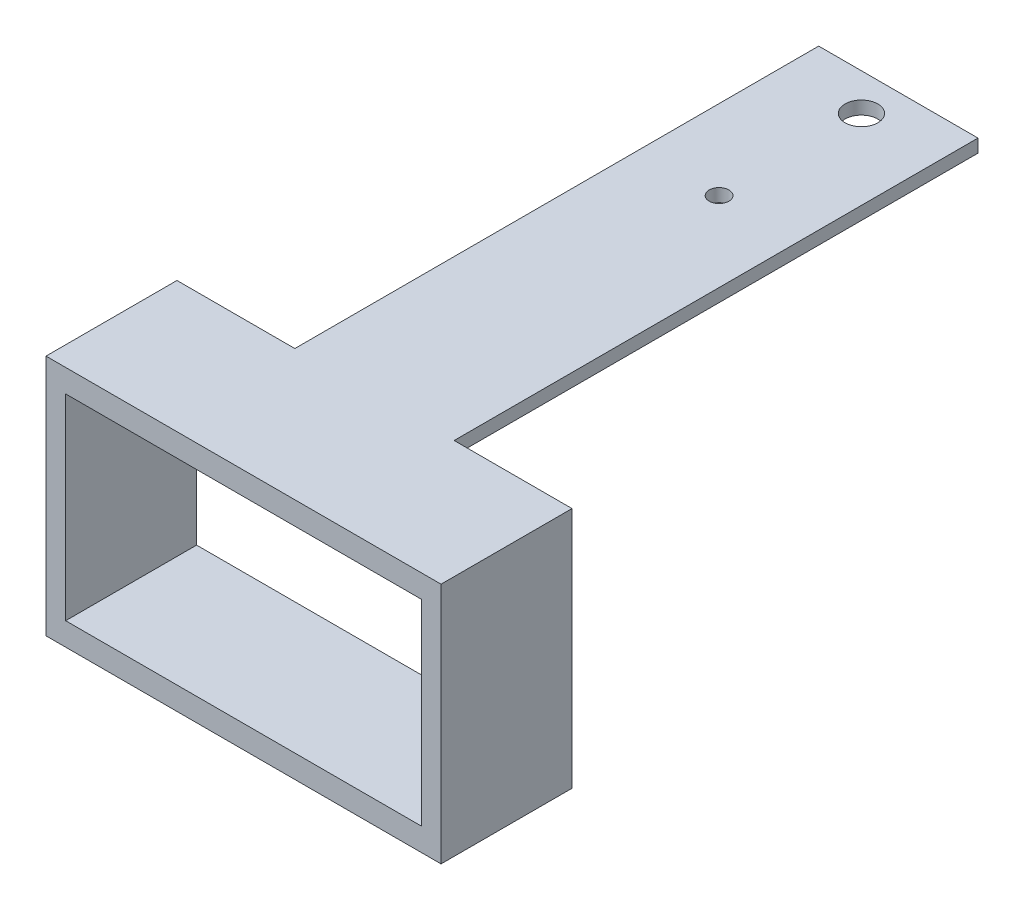
ISO-10303-21;
HEADER;
FILE_DESCRIPTION(('STEP AP214'),'2;1');
FILE_NAME('part.step','',(''),(''),'','','');
FILE_SCHEMA(('AUTOMOTIVE_DESIGN { 1 0 10303 214 1 1 1 1 }'));
ENDSEC;
DATA;
#1=APPLICATION_CONTEXT('core data for automotive mechanical design processes');
#2=APPLICATION_PROTOCOL_DEFINITION('international standard','automotive_design',2000,#1);
#3=PRODUCT_CONTEXT('',#1,'mechanical');
#4=PRODUCT('Part','Part','',(#3));
#5=PRODUCT_RELATED_PRODUCT_CATEGORY('part','',(#4));
#6=PRODUCT_DEFINITION_FORMATION('','',#4);
#7=PRODUCT_DEFINITION_CONTEXT('part definition',#1,'design');
#8=PRODUCT_DEFINITION('design','',#6,#7);
#9=PRODUCT_DEFINITION_SHAPE('','',#8);
#10=(LENGTH_UNIT() NAMED_UNIT(*) SI_UNIT(.MILLI.,.METRE.));
#11=(NAMED_UNIT(*) PLANE_ANGLE_UNIT() SI_UNIT($,.RADIAN.));
#12=(NAMED_UNIT(*) SI_UNIT($,.STERADIAN.) SOLID_ANGLE_UNIT());
#13=UNCERTAINTY_MEASURE_WITH_UNIT(LENGTH_MEASURE(1.E-05),#10,'distance_accuracy_value','');
#14=(GEOMETRIC_REPRESENTATION_CONTEXT(3) GLOBAL_UNCERTAINTY_ASSIGNED_CONTEXT((#13)) GLOBAL_UNIT_ASSIGNED_CONTEXT((#10,
#11,#12)) REPRESENTATION_CONTEXT('',''));
#15=CARTESIAN_POINT('',(0.,0.,0.));
#16=DIRECTION('',(0.,0.,1.));
#17=DIRECTION('',(1.,0.,0.));
#18=AXIS2_PLACEMENT_3D('',#15,#16,#17);
#19=CARTESIAN_POINT('',(-7.94117647058824,2.,36.4705882352941));
#20=DIRECTION('',(1.,0.,0.));
#21=DIRECTION('',(0.,0.,-1.));
#22=AXIS2_PLACEMENT_3D('',#19,#20,#21);
#23=PLANE('',#22);
#24=DIRECTION('',(0.,0.,1.));
#25=VECTOR('',#24,1.);
#26=CARTESIAN_POINT('',(-7.94117647058824,0.,36.4705882352941));
#27=LINE('',#26,#25);
#28=CARTESIAN_POINT('',(-7.94117647058824,0.,-43.5294117647059));
#29=VERTEX_POINT('',#28);
#30=CARTESIAN_POINT('',(-7.94117647058824,0.,36.4705882352941));
#31=VERTEX_POINT('',#30);
#32=EDGE_CURVE('E141',#29,#31,#27,.T.);
#33=ORIENTED_EDGE('',*,*,#32,.T.);
#34=DIRECTION('',(0.,-1.,0.));
#35=VECTOR('',#34,1.);
#36=CARTESIAN_POINT('',(-7.94117647058824,2.,36.4705882352941));
#37=LINE('',#36,#35);
#38=CARTESIAN_POINT('',(-7.94117647058824,2.,36.4705882352941));
#39=VERTEX_POINT('',#38);
#40=EDGE_CURVE('E42',#39,#31,#37,.T.);
#41=ORIENTED_EDGE('',*,*,#40,.F.);
#42=DIRECTION('',(0.,0.,1.));
#43=VECTOR('',#42,1.);
#44=CARTESIAN_POINT('',(-7.94117647058824,2.,36.4705882352941));
#45=LINE('',#44,#43);
#46=CARTESIAN_POINT('',(-7.94117647058824,2.,-43.5294117647059));
#47=VERTEX_POINT('',#46);
#48=EDGE_CURVE('E140',#47,#39,#45,.T.);
#49=ORIENTED_EDGE('',*,*,#48,.F.);
#50=DIRECTION('',(0.,1.,0.));
#51=VECTOR('',#50,1.);
#52=CARTESIAN_POINT('',(-7.94117647058824,0.,-43.5294117647059));
#53=LINE('',#52,#51);
#54=EDGE_CURVE('E151',#29,#47,#53,.T.);
#55=ORIENTED_EDGE('',*,*,#54,.F.);
#56=EDGE_LOOP('',(#33,#41,#49,#55));
#57=FACE_BOUND('',#56,.T.);
#58=ADVANCED_FACE('F39',(#57),#23,.F.);
#59=CARTESIAN_POINT('',(-25.9411764705882,2.,56.4705882352941));
#60=DIRECTION('',(1.,0.,0.));
#61=DIRECTION('',(0.,0.,-1.));
#62=AXIS2_PLACEMENT_3D('',#59,#60,#61);
#63=PLANE('',#62);
#64=DIRECTION('',(0.,-1.,0.));
#65=VECTOR('',#64,1.);
#66=CARTESIAN_POINT('',(-25.9411764705882,2.,36.4705882352941));
#67=LINE('',#66,#65);
#68=CARTESIAN_POINT('',(-25.9411764705882,2.,36.4705882352941));
#69=VERTEX_POINT('',#68);
#70=CARTESIAN_POINT('',(-25.9411764705882,-35.,36.4705882352941));
#71=VERTEX_POINT('',#70);
#72=EDGE_CURVE('E265',#69,#71,#67,.T.);
#73=ORIENTED_EDGE('',*,*,#72,.T.);
#74=DIRECTION('',(0.,0.,-1.));
#75=VECTOR('',#74,1.);
#76=CARTESIAN_POINT('',(-25.9411764705882,-35.,56.4705882352941));
#77=LINE('',#76,#75);
#78=CARTESIAN_POINT('',(-25.9411764705882,-35.,56.4705882352941));
#79=VERTEX_POINT('',#78);
#80=EDGE_CURVE('E183',#79,#71,#77,.T.);
#81=ORIENTED_EDGE('',*,*,#80,.F.);
#82=DIRECTION('',(0.,-1.,0.));
#83=VECTOR('',#82,1.);
#84=CARTESIAN_POINT('',(-25.9411764705882,2.,56.4705882352941));
#85=LINE('',#84,#83);
#86=CARTESIAN_POINT('',(-25.9411764705882,2.,56.4705882352941));
#87=VERTEX_POINT('',#86);
#88=EDGE_CURVE('E263',#87,#79,#85,.T.);
#89=ORIENTED_EDGE('',*,*,#88,.F.);
#90=DIRECTION('',(0.,0.,1.));
#91=VECTOR('',#90,1.);
#92=CARTESIAN_POINT('',(-25.9411764705882,2.,56.4705882352941));
#93=LINE('',#92,#91);
#94=EDGE_CURVE('E238',#69,#87,#93,.T.);
#95=ORIENTED_EDGE('',*,*,#94,.F.);
#96=EDGE_LOOP('',(#73,#81,#89,#95));
#97=FACE_BOUND('',#96,.T.);
#98=ADVANCED_FACE('F294',(#97),#63,.F.);
#99=CARTESIAN_POINT('',(34.3888235294118,2.,56.4705882352941));
#100=DIRECTION('',(0.,0.,-1.));
#101=DIRECTION('',(-1.,0.,0.));
#102=AXIS2_PLACEMENT_3D('',#99,#100,#101);
#103=PLANE('',#102);
#104=DIRECTION('',(0.,-1.,0.));
#105=VECTOR('',#104,1.);
#106=CARTESIAN_POINT('',(31.3888235294118,-28.5,56.4705882352941));
#107=LINE('',#106,#105);
#108=CARTESIAN_POINT('',(31.3888235294118,-1.50000000000001,56.4705882352941));
#109=VERTEX_POINT('',#108);
#110=CARTESIAN_POINT('',(31.3888235294118,-31.5,56.4705882352941));
#111=VERTEX_POINT('',#110);
#112=EDGE_CURVE('E55',#109,#111,#107,.T.);
#113=ORIENTED_EDGE('',*,*,#112,.T.);
#114=DIRECTION('',(1.,0.,0.));
#115=VECTOR('',#114,1.);
#116=CARTESIAN_POINT('',(31.3888235294118,-31.5,56.4705882352941));
#117=LINE('',#116,#115);
#118=CARTESIAN_POINT('',(-22.9411764705882,-31.5,56.4705882352941));
#119=VERTEX_POINT('',#118);
#120=EDGE_CURVE('E179',#119,#111,#117,.T.);
#121=ORIENTED_EDGE('',*,*,#120,.F.);
#122=DIRECTION('',(0.,1.,0.));
#123=VECTOR('',#122,1.);
#124=CARTESIAN_POINT('',(-22.9411764705882,-28.5,56.4705882352941));
#125=LINE('',#124,#123);
#126=CARTESIAN_POINT('',(-22.9411764705882,-1.5,56.4705882352941));
#127=VERTEX_POINT('',#126);
#128=EDGE_CURVE('E207',#119,#127,#125,.T.);
#129=ORIENTED_EDGE('',*,*,#128,.T.);
#130=DIRECTION('',(1.,0.,0.));
#131=VECTOR('',#130,1.);
#132=CARTESIAN_POINT('',(-22.9411764705882,-1.5,56.4705882352941));
#133=LINE('',#132,#131);
#134=EDGE_CURVE('E211',#127,#109,#133,.T.);
#135=ORIENTED_EDGE('',*,*,#134,.T.);
#136=EDGE_LOOP('',(#113,#121,#129,#135));
#137=FACE_BOUND('',#136,.T.);
#138=ORIENTED_EDGE('',*,*,#88,.T.);
#139=DIRECTION('',(-1.,0.,0.));
#140=VECTOR('',#139,1.);
#141=CARTESIAN_POINT('',(-25.9411764705882,-35.,56.4705882352941));
#142=LINE('',#141,#140);
#143=CARTESIAN_POINT('',(34.3888235294118,-35.,56.4705882352941));
#144=VERTEX_POINT('',#143);
#145=EDGE_CURVE('E195',#144,#79,#142,.T.);
#146=ORIENTED_EDGE('',*,*,#145,.F.);
#147=DIRECTION('',(0.,-1.,0.));
#148=VECTOR('',#147,1.);
#149=CARTESIAN_POINT('',(34.3888235294118,2.,56.4705882352941));
#150=LINE('',#149,#148);
#151=CARTESIAN_POINT('',(34.3888235294118,2.,56.4705882352941));
#152=VERTEX_POINT('',#151);
#153=EDGE_CURVE('E260',#152,#144,#150,.T.);
#154=ORIENTED_EDGE('',*,*,#153,.F.);
#155=DIRECTION('',(1.,0.,0.));
#156=VECTOR('',#155,1.);
#157=CARTESIAN_POINT('',(34.3888235294118,2.,56.4705882352941));
#158=LINE('',#157,#156);
#159=EDGE_CURVE('E241',#87,#152,#158,.T.);
#160=ORIENTED_EDGE('',*,*,#159,.F.);
#161=EDGE_LOOP('',(#138,#146,#154,#160));
#162=FACE_BOUND('',#161,.T.);
#163=ADVANCED_FACE('F292',(#137,#162),#103,.F.);
#164=CARTESIAN_POINT('',(34.3888235294118,2.,36.4705882352941));
#165=DIRECTION('',(-1.,0.,0.));
#166=DIRECTION('',(0.,0.,1.));
#167=AXIS2_PLACEMENT_3D('',#164,#165,#166);
#168=PLANE('',#167);
#169=ORIENTED_EDGE('',*,*,#153,.T.);
#170=DIRECTION('',(0.,0.,1.));
#171=VECTOR('',#170,1.);
#172=CARTESIAN_POINT('',(34.3888235294118,-35.,56.4705882352941));
#173=LINE('',#172,#171);
#174=CARTESIAN_POINT('',(34.3888235294118,-35.,36.4705882352941));
#175=VERTEX_POINT('',#174);
#176=EDGE_CURVE('E191',#175,#144,#173,.T.);
#177=ORIENTED_EDGE('',*,*,#176,.F.);
#178=DIRECTION('',(0.,-1.,0.));
#179=VECTOR('',#178,1.);
#180=CARTESIAN_POINT('',(34.3888235294118,2.,36.4705882352941));
#181=LINE('',#180,#179);
#182=CARTESIAN_POINT('',(34.3888235294118,2.,36.4705882352941));
#183=VERTEX_POINT('',#182);
#184=EDGE_CURVE('E257',#183,#175,#181,.T.);
#185=ORIENTED_EDGE('',*,*,#184,.F.);
#186=DIRECTION('',(0.,0.,-1.));
#187=VECTOR('',#186,1.);
#188=CARTESIAN_POINT('',(34.3888235294118,2.,36.4705882352941));
#189=LINE('',#188,#187);
#190=EDGE_CURVE('E244',#152,#183,#189,.T.);
#191=ORIENTED_EDGE('',*,*,#190,.F.);
#192=EDGE_LOOP('',(#169,#177,#185,#191));
#193=FACE_BOUND('',#192,.T.);
#194=ADVANCED_FACE('F288',(#193),#168,.F.);
#195=CARTESIAN_POINT('',(16.3888235294118,2.,36.4705882352941));
#196=DIRECTION('',(0.,0.,1.));
#197=DIRECTION('',(1.,0.,0.));
#198=AXIS2_PLACEMENT_3D('',#195,#196,#197);
#199=PLANE('',#198);
#200=DIRECTION('',(-1.,0.,0.));
#201=VECTOR('',#200,1.);
#202=CARTESIAN_POINT('',(31.3888235294118,-31.5,36.4705882352941));
#203=LINE('',#202,#201);
#204=CARTESIAN_POINT('',(31.3888235294118,-31.5,36.4705882352941));
#205=VERTEX_POINT('',#204);
#206=CARTESIAN_POINT('',(-22.9411764705882,-31.5,36.4705882352941));
#207=VERTEX_POINT('',#206);
#208=EDGE_CURVE('E171',#205,#207,#203,.T.);
#209=ORIENTED_EDGE('',*,*,#208,.F.);
#210=DIRECTION('',(0.,-1.,0.));
#211=VECTOR('',#210,1.);
#212=CARTESIAN_POINT('',(31.3888235294118,-28.5,36.4705882352941));
#213=LINE('',#212,#211);
#214=CARTESIAN_POINT('',(31.3888235294118,-1.50000000000001,36.4705882352941));
#215=VERTEX_POINT('',#214);
#216=EDGE_CURVE('E212',#215,#205,#213,.T.);
#217=ORIENTED_EDGE('',*,*,#216,.F.);
#218=DIRECTION('',(1.,0.,0.));
#219=VECTOR('',#218,1.);
#220=CARTESIAN_POINT('',(-22.9411764705882,-1.5,36.4705882352941));
#221=LINE('',#220,#219);
#222=CARTESIAN_POINT('',(-22.9411764705882,-1.5,36.4705882352941));
#223=VERTEX_POINT('',#222);
#224=EDGE_CURVE('E221',#223,#215,#221,.T.);
#225=ORIENTED_EDGE('',*,*,#224,.F.);
#226=DIRECTION('',(0.,1.,0.));
#227=VECTOR('',#226,1.);
#228=CARTESIAN_POINT('',(-22.9411764705882,-28.5,36.4705882352941));
#229=LINE('',#228,#227);
#230=EDGE_CURVE('E63',#207,#223,#229,.T.);
#231=ORIENTED_EDGE('',*,*,#230,.F.);
#232=EDGE_LOOP('',(#209,#217,#225,#231));
#233=FACE_BOUND('',#232,.T.);
#234=ORIENTED_EDGE('',*,*,#184,.T.);
#235=DIRECTION('',(1.,0.,0.));
#236=VECTOR('',#235,1.);
#237=CARTESIAN_POINT('',(-25.9411764705882,-35.,36.4705882352941));
#238=LINE('',#237,#236);
#239=EDGE_CURVE('E187',#71,#175,#238,.T.);
#240=ORIENTED_EDGE('',*,*,#239,.F.);
#241=ORIENTED_EDGE('',*,*,#72,.F.);
#242=DIRECTION('',(-1.,0.,0.));
#243=VECTOR('',#242,1.);
#244=CARTESIAN_POINT('',(-25.9411764705882,2.,36.4705882352941));
#245=LINE('',#244,#243);
#246=EDGE_CURVE('E235',#39,#69,#245,.T.);
#247=ORIENTED_EDGE('',*,*,#246,.F.);
#248=ORIENTED_EDGE('',*,*,#40,.T.);
#249=DIRECTION('',(1.,0.,0.));
#250=VECTOR('',#249,1.);
#251=CARTESIAN_POINT('',(-25.9411764705882,0.,36.4705882352941));
#252=LINE('',#251,#250);
#253=CARTESIAN_POINT('',(16.3888235294118,0.,36.4705882352941));
#254=VERTEX_POINT('',#253);
#255=EDGE_CURVE('E11',#31,#254,#252,.T.);
#256=ORIENTED_EDGE('',*,*,#255,.T.);
#257=DIRECTION('',(0.,-1.,0.));
#258=VECTOR('',#257,1.);
#259=CARTESIAN_POINT('',(16.3888235294118,2.,36.4705882352941));
#260=LINE('',#259,#258);
#261=CARTESIAN_POINT('',(16.3888235294118,2.,36.4705882352941));
#262=VERTEX_POINT('',#261);
#263=EDGE_CURVE('E136',#262,#254,#260,.T.);
#264=ORIENTED_EDGE('',*,*,#263,.F.);
#265=DIRECTION('',(-1.,0.,0.));
#266=VECTOR('',#265,1.);
#267=CARTESIAN_POINT('',(16.3888235294118,2.,36.4705882352941));
#268=LINE('',#267,#266);
#269=EDGE_CURVE('E247',#183,#262,#268,.T.);
#270=ORIENTED_EDGE('',*,*,#269,.F.);
#271=EDGE_LOOP('',(#234,#240,#241,#247,#248,#256,#264,#270));
#272=FACE_BOUND('',#271,.T.);
#273=ADVANCED_FACE('F276',(#233,#272),#199,.F.);
#274=CARTESIAN_POINT('',(16.3888235294118,2.,-23.5294117647059));
#275=DIRECTION('',(-1.,0.,0.));
#276=DIRECTION('',(0.,0.,1.));
#277=AXIS2_PLACEMENT_3D('',#274,#275,#276);
#278=PLANE('',#277);
#279=DIRECTION('',(0.,0.,-1.));
#280=VECTOR('',#279,1.);
#281=CARTESIAN_POINT('',(16.3888235294118,0.,-23.5294117647059));
#282=LINE('',#281,#280);
#283=CARTESIAN_POINT('',(16.3888235294118,0.,-43.5294117647059));
#284=VERTEX_POINT('',#283);
#285=EDGE_CURVE('E129',#254,#284,#282,.T.);
#286=ORIENTED_EDGE('',*,*,#285,.T.);
#287=DIRECTION('',(0.,1.,0.));
#288=VECTOR('',#287,1.);
#289=CARTESIAN_POINT('',(16.3888235294118,0.,-43.5294117647059));
#290=LINE('',#289,#288);
#291=CARTESIAN_POINT('',(16.3888235294118,2.,-43.5294117647059));
#292=VERTEX_POINT('',#291);
#293=EDGE_CURVE('E133',#284,#292,#290,.T.);
#294=ORIENTED_EDGE('',*,*,#293,.T.);
#295=DIRECTION('',(0.,0.,-1.));
#296=VECTOR('',#295,1.);
#297=CARTESIAN_POINT('',(16.3888235294118,2.,-23.5294117647059));
#298=LINE('',#297,#296);
#299=EDGE_CURVE('E250',#262,#292,#298,.T.);
#300=ORIENTED_EDGE('',*,*,#299,.F.);
#301=ORIENTED_EDGE('',*,*,#263,.T.);
#302=EDGE_LOOP('',(#286,#294,#300,#301));
#303=FACE_BOUND('',#302,.T.);
#304=ADVANCED_FACE('F131',(#303),#278,.F.);
#305=CARTESIAN_POINT('',(0.,2.,0.));
#306=DIRECTION('',(0.,-1.,0.));
#307=DIRECTION('',(0.,0.,-1.));
#308=AXIS2_PLACEMENT_3D('',#305,#306,#307);
#309=PLANE('',#308);
#310=CARTESIAN_POINT('',(4.22382352941176,2.,-37.8934272011122));
#311=DIRECTION('',(0.,-1.,0.));
#312=DIRECTION('',(0.,0.,-1.));
#313=AXIS2_PLACEMENT_3D('',#310,#311,#312);
#314=CIRCLE('',#313,2.5);
#315=CARTESIAN_POINT('',(4.22382352941176,2.,-40.3934272011122));
#316=VERTEX_POINT('',#315);
#317=EDGE_CURVE('E159',#316,#316,#314,.T.);
#318=ORIENTED_EDGE('',*,*,#317,.T.);
#319=EDGE_LOOP('',(#318));
#320=FACE_BOUND('',#319,.T.);
#321=CARTESIAN_POINT('',(4.22382352941176,2.,-16.1506031000727));
#322=DIRECTION('',(0.,-1.,0.));
#323=DIRECTION('',(0.,0.,-1.));
#324=AXIS2_PLACEMENT_3D('',#321,#322,#323);
#325=CIRCLE('',#324,1.5);
#326=CARTESIAN_POINT('',(4.22382352941176,2.,-17.6506031000727));
#327=VERTEX_POINT('',#326);
#328=EDGE_CURVE('E200',#327,#327,#325,.T.);
#329=ORIENTED_EDGE('',*,*,#328,.T.);
#330=EDGE_LOOP('',(#329));
#331=FACE_BOUND('',#330,.T.);
#332=ORIENTED_EDGE('',*,*,#48,.T.);
#333=ORIENTED_EDGE('',*,*,#246,.T.);
#334=ORIENTED_EDGE('',*,*,#94,.T.);
#335=ORIENTED_EDGE('',*,*,#159,.T.);
#336=ORIENTED_EDGE('',*,*,#190,.T.);
#337=ORIENTED_EDGE('',*,*,#269,.T.);
#338=ORIENTED_EDGE('',*,*,#299,.T.);
#339=DIRECTION('',(-1.,0.,0.));
#340=VECTOR('',#339,1.);
#341=CARTESIAN_POINT('',(-7.94117647058824,2.,-43.5294117647059));
#342=LINE('',#341,#340);
#343=EDGE_CURVE('E149',#292,#47,#342,.T.);
#344=ORIENTED_EDGE('',*,*,#343,.T.);
#345=EDGE_LOOP('',(#332,#333,#334,#335,#336,#337,#338,#344));
#346=FACE_BOUND('',#345,.T.);
#347=ADVANCED_FACE('F279',(#320,#331,#346),#309,.F.);
#348=CARTESIAN_POINT('',(0.,0.,0.));
#349=DIRECTION('',(0.,-1.,0.));
#350=DIRECTION('',(0.,0.,-1.));
#351=AXIS2_PLACEMENT_3D('',#348,#349,#350);
#352=PLANE('',#351);
#353=CARTESIAN_POINT('',(4.22382352941176,0.,-37.8934272011122));
#354=DIRECTION('',(0.,-1.,0.));
#355=DIRECTION('',(0.,0.,-1.));
#356=AXIS2_PLACEMENT_3D('',#353,#354,#355);
#357=CIRCLE('',#356,2.5);
#358=CARTESIAN_POINT('',(4.22382352941176,0.,-40.3934272011122));
#359=VERTEX_POINT('',#358);
#360=EDGE_CURVE('E162',#359,#359,#357,.T.);
#361=ORIENTED_EDGE('',*,*,#360,.F.);
#362=EDGE_LOOP('',(#361));
#363=FACE_BOUND('',#362,.T.);
#364=CARTESIAN_POINT('',(4.22382352941176,0.,-16.1506031000727));
#365=DIRECTION('',(0.,-1.,0.));
#366=DIRECTION('',(0.,0.,-1.));
#367=AXIS2_PLACEMENT_3D('',#364,#365,#366);
#368=CIRCLE('',#367,1.5);
#369=CARTESIAN_POINT('',(4.22382352941176,0.,-17.6506031000727));
#370=VERTEX_POINT('',#369);
#371=EDGE_CURVE('E199',#370,#370,#368,.T.);
#372=ORIENTED_EDGE('',*,*,#371,.F.);
#373=EDGE_LOOP('',(#372));
#374=FACE_BOUND('',#373,.T.);
#375=ORIENTED_EDGE('',*,*,#255,.F.);
#376=ORIENTED_EDGE('',*,*,#32,.F.);
#377=DIRECTION('',(-1.,0.,0.));
#378=VECTOR('',#377,1.);
#379=CARTESIAN_POINT('',(-7.94117647058824,0.,-43.5294117647059));
#380=LINE('',#379,#378);
#381=EDGE_CURVE('E147',#284,#29,#380,.T.);
#382=ORIENTED_EDGE('',*,*,#381,.F.);
#383=ORIENTED_EDGE('',*,*,#285,.F.);
#384=EDGE_LOOP('',(#375,#376,#382,#383));
#385=FACE_BOUND('',#384,.T.);
#386=ADVANCED_FACE('F153',(#363,#374,#385),#352,.T.);
#387=CARTESIAN_POINT('',(-22.9411764705882,-28.5,56.4705882352941));
#388=DIRECTION('',(-1.,0.,0.));
#389=DIRECTION('',(0.,0.,1.));
#390=AXIS2_PLACEMENT_3D('',#387,#388,#389);
#391=PLANE('',#390);
#392=ORIENTED_EDGE('',*,*,#230,.T.);
#393=DIRECTION('',(0.,0.,-1.));
#394=VECTOR('',#393,1.);
#395=CARTESIAN_POINT('',(-22.9411764705882,-1.5,56.4705882352941));
#396=LINE('',#395,#394);
#397=EDGE_CURVE('E218',#127,#223,#396,.T.);
#398=ORIENTED_EDGE('',*,*,#397,.F.);
#399=ORIENTED_EDGE('',*,*,#128,.F.);
#400=DIRECTION('',(0.,0.,1.));
#401=VECTOR('',#400,1.);
#402=CARTESIAN_POINT('',(-22.9411764705882,-31.5,36.4705882352941));
#403=LINE('',#402,#401);
#404=EDGE_CURVE('E175',#207,#119,#403,.T.);
#405=ORIENTED_EDGE('',*,*,#404,.F.);
#406=EDGE_LOOP('',(#392,#398,#399,#405));
#407=FACE_BOUND('',#406,.T.);
#408=ADVANCED_FACE('F313',(#407),#391,.F.);
#409=CARTESIAN_POINT('',(31.3888235294118,-28.5,56.4705882352941));
#410=DIRECTION('',(1.,0.,0.));
#411=DIRECTION('',(0.,0.,-1.));
#412=AXIS2_PLACEMENT_3D('',#409,#410,#411);
#413=PLANE('',#412);
#414=ORIENTED_EDGE('',*,*,#216,.T.);
#415=DIRECTION('',(0.,0.,-1.));
#416=VECTOR('',#415,1.);
#417=CARTESIAN_POINT('',(31.3888235294118,-31.5,36.4705882352941));
#418=LINE('',#417,#416);
#419=EDGE_CURVE('E166',#111,#205,#418,.T.);
#420=ORIENTED_EDGE('',*,*,#419,.F.);
#421=ORIENTED_EDGE('',*,*,#112,.F.);
#422=DIRECTION('',(0.,0.,-1.));
#423=VECTOR('',#422,1.);
#424=CARTESIAN_POINT('',(31.3888235294118,-1.50000000000001,56.4705882352941));
#425=LINE('',#424,#423);
#426=EDGE_CURVE('E227',#109,#215,#425,.T.);
#427=ORIENTED_EDGE('',*,*,#426,.T.);
#428=EDGE_LOOP('',(#414,#420,#421,#427));
#429=FACE_BOUND('',#428,.T.);
#430=ADVANCED_FACE('F320',(#429),#413,.F.);
#431=CARTESIAN_POINT('',(-22.9411764705882,-1.5,56.4705882352941));
#432=DIRECTION('',(0.,1.,0.));
#433=DIRECTION('',(-1.,0.,0.));
#434=AXIS2_PLACEMENT_3D('',#431,#432,#433);
#435=PLANE('',#434);
#436=ORIENTED_EDGE('',*,*,#224,.T.);
#437=ORIENTED_EDGE('',*,*,#426,.F.);
#438=ORIENTED_EDGE('',*,*,#134,.F.);
#439=ORIENTED_EDGE('',*,*,#397,.T.);
#440=EDGE_LOOP('',(#436,#437,#438,#439));
#441=FACE_BOUND('',#440,.T.);
#442=ADVANCED_FACE('F321',(#441),#435,.F.);
#443=CARTESIAN_POINT('',(4.22382352941176,2.,-16.1506031000727));
#444=DIRECTION('',(0.,-1.,0.));
#445=DIRECTION('',(0.,0.,-1.));
#446=AXIS2_PLACEMENT_3D('',#443,#444,#445);
#447=CYLINDRICAL_SURFACE('',#446,1.5);
#448=ORIENTED_EDGE('',*,*,#328,.F.);
#449=EDGE_LOOP('',(#448));
#450=FACE_BOUND('',#449,.T.);
#451=ORIENTED_EDGE('',*,*,#371,.T.);
#452=EDGE_LOOP('',(#451));
#453=FACE_BOUND('',#452,.T.);
#454=ADVANCED_FACE('F324',(#450,#453),#447,.F.);
#455=CARTESIAN_POINT('',(0.,-35.,0.));
#456=DIRECTION('',(0.,-1.,0.));
#457=DIRECTION('',(0.,0.,-1.));
#458=AXIS2_PLACEMENT_3D('',#455,#456,#457);
#459=PLANE('',#458);
#460=ORIENTED_EDGE('',*,*,#80,.T.);
#461=ORIENTED_EDGE('',*,*,#239,.T.);
#462=ORIENTED_EDGE('',*,*,#176,.T.);
#463=ORIENTED_EDGE('',*,*,#145,.T.);
#464=EDGE_LOOP('',(#460,#461,#462,#463));
#465=FACE_BOUND('',#464,.T.);
#466=ADVANCED_FACE('F286',(#465),#459,.T.);
#467=CARTESIAN_POINT('',(0.,-31.5,0.));
#468=DIRECTION('',(0.,-1.,0.));
#469=DIRECTION('',(1.,0.,0.));
#470=AXIS2_PLACEMENT_3D('',#467,#468,#469);
#471=PLANE('',#470);
#472=ORIENTED_EDGE('',*,*,#419,.T.);
#473=ORIENTED_EDGE('',*,*,#208,.T.);
#474=ORIENTED_EDGE('',*,*,#404,.T.);
#475=ORIENTED_EDGE('',*,*,#120,.T.);
#476=EDGE_LOOP('',(#472,#473,#474,#475));
#477=FACE_BOUND('',#476,.T.);
#478=ADVANCED_FACE('F332',(#477),#471,.F.);
#479=CARTESIAN_POINT('',(-7.94117647058824,0.,-43.5294117647059));
#480=DIRECTION('',(0.,0.,-1.));
#481=DIRECTION('',(-1.,0.,0.));
#482=AXIS2_PLACEMENT_3D('',#479,#480,#481);
#483=PLANE('',#482);
#484=ORIENTED_EDGE('',*,*,#343,.F.);
#485=ORIENTED_EDGE('',*,*,#293,.F.);
#486=ORIENTED_EDGE('',*,*,#381,.T.);
#487=ORIENTED_EDGE('',*,*,#54,.T.);
#488=EDGE_LOOP('',(#484,#485,#486,#487));
#489=FACE_BOUND('',#488,.T.);
#490=ADVANCED_FACE('F145',(#489),#483,.T.);
#491=CARTESIAN_POINT('',(4.22382352941176,2.,-37.8934272011122));
#492=DIRECTION('',(0.,-1.,0.));
#493=DIRECTION('',(0.,0.,-1.));
#494=AXIS2_PLACEMENT_3D('',#491,#492,#493);
#495=CYLINDRICAL_SURFACE('',#494,2.5);
#496=ORIENTED_EDGE('',*,*,#317,.F.);
#497=EDGE_LOOP('',(#496));
#498=FACE_BOUND('',#497,.T.);
#499=ORIENTED_EDGE('',*,*,#360,.T.);
#500=EDGE_LOOP('',(#499));
#501=FACE_BOUND('',#500,.T.);
#502=ADVANCED_FACE('F338',(#498,#501),#495,.F.);
#503=CLOSED_SHELL('',(#58,#98,#163,#194,#273,#304,#347,#386,#408,#430,#442,#454,#466,#478,#490,#502));
#504=MANIFOLD_SOLID_BREP('B2',#503);
#505=ADVANCED_BREP_SHAPE_REPRESENTATION('',(#18,#504),#14);
#506=SHAPE_DEFINITION_REPRESENTATION(#9,#505);
ENDSEC;
END-ISO-10303-21;
